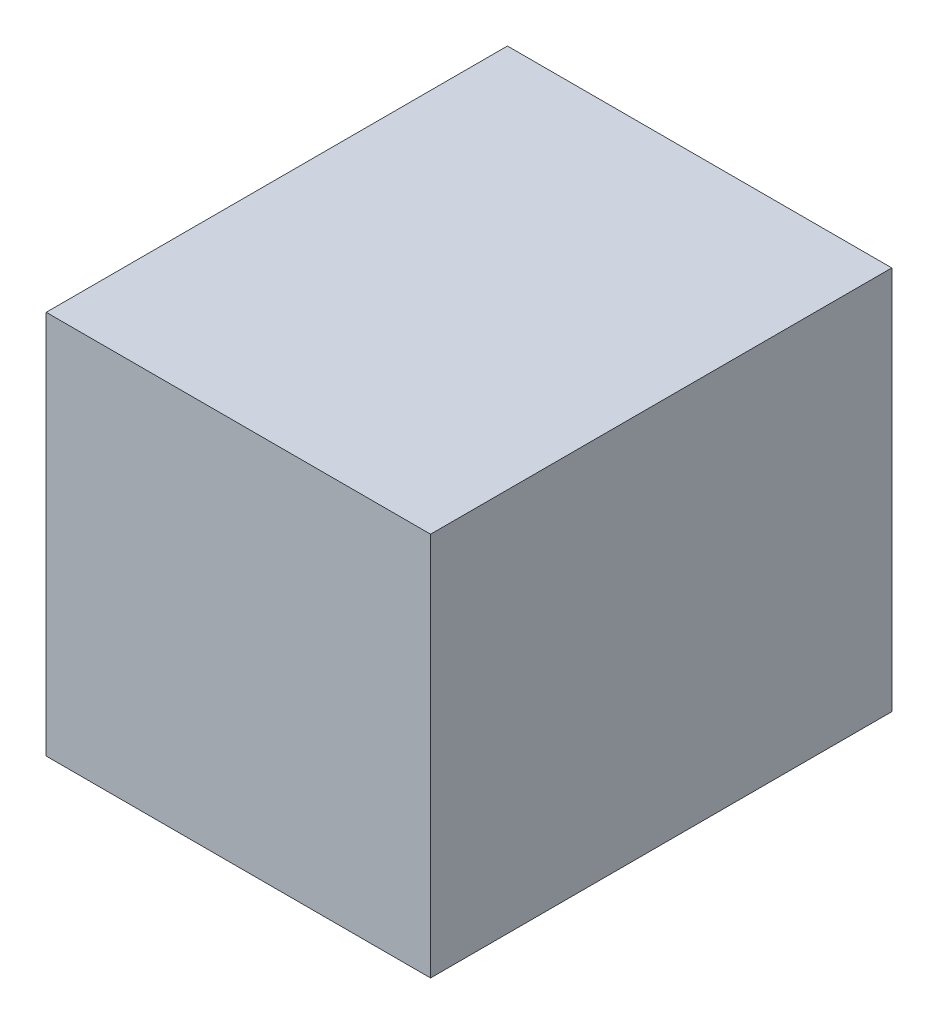
ISO-10303-21;
HEADER;
FILE_DESCRIPTION(('STEP AP214'),'2;1');
FILE_NAME('part.step','',(''),(''),'','','');
FILE_SCHEMA(('AUTOMOTIVE_DESIGN { 1 0 10303 214 1 1 1 1 }'));
ENDSEC;
DATA;
#1=APPLICATION_CONTEXT('core data for automotive mechanical design processes');
#2=APPLICATION_PROTOCOL_DEFINITION('international standard','automotive_design',2000,#1);
#3=PRODUCT_CONTEXT('',#1,'mechanical');
#4=PRODUCT('Part','Part','',(#3));
#5=PRODUCT_RELATED_PRODUCT_CATEGORY('part','',(#4));
#6=PRODUCT_DEFINITION_FORMATION('','',#4);
#7=PRODUCT_DEFINITION_CONTEXT('part definition',#1,'design');
#8=PRODUCT_DEFINITION('design','',#6,#7);
#9=PRODUCT_DEFINITION_SHAPE('','',#8);
#10=(LENGTH_UNIT() NAMED_UNIT(*) SI_UNIT(.MILLI.,.METRE.));
#11=(NAMED_UNIT(*) PLANE_ANGLE_UNIT() SI_UNIT($,.RADIAN.));
#12=(NAMED_UNIT(*) SI_UNIT($,.STERADIAN.) SOLID_ANGLE_UNIT());
#13=UNCERTAINTY_MEASURE_WITH_UNIT(LENGTH_MEASURE(1.E-05),#10,'distance_accuracy_value','');
#14=(GEOMETRIC_REPRESENTATION_CONTEXT(3) GLOBAL_UNCERTAINTY_ASSIGNED_CONTEXT((#13)) GLOBAL_UNIT_ASSIGNED_CONTEXT((#10,
#11,#12)) REPRESENTATION_CONTEXT('',''));
#15=CARTESIAN_POINT('',(0.,0.,0.));
#16=DIRECTION('',(0.,0.,1.));
#17=DIRECTION('',(1.,0.,0.));
#18=AXIS2_PLACEMENT_3D('',#15,#16,#17);
#19=CARTESIAN_POINT('',(2.5,-2.5,3.));
#20=DIRECTION('',(-1.,0.,0.));
#21=DIRECTION('',(0.,0.,1.));
#22=AXIS2_PLACEMENT_3D('',#19,#20,#21);
#23=PLANE('',#22);
#24=DIRECTION('',(0.,1.,0.));
#25=VECTOR('',#24,1.);
#26=CARTESIAN_POINT('',(2.5,-2.5,-3.));
#27=LINE('',#26,#25);
#28=CARTESIAN_POINT('',(2.5,-2.5,-3.));
#29=VERTEX_POINT('',#28);
#30=CARTESIAN_POINT('',(2.5,2.5,-3.));
#31=VERTEX_POINT('',#30);
#32=EDGE_CURVE('E96',#29,#31,#27,.T.);
#33=ORIENTED_EDGE('',*,*,#32,.T.);
#34=DIRECTION('',(0.,0.,-1.));
#35=VECTOR('',#34,1.);
#36=CARTESIAN_POINT('',(2.5,2.5,3.));
#37=LINE('',#36,#35);
#38=CARTESIAN_POINT('',(2.5,2.5,3.));
#39=VERTEX_POINT('',#38);
#40=EDGE_CURVE('E11',#39,#31,#37,.T.);
#41=ORIENTED_EDGE('',*,*,#40,.F.);
#42=DIRECTION('',(0.,1.,0.));
#43=VECTOR('',#42,1.);
#44=CARTESIAN_POINT('',(2.5,-2.5,3.));
#45=LINE('',#44,#43);
#46=CARTESIAN_POINT('',(2.5,-2.5,3.));
#47=VERTEX_POINT('',#46);
#48=EDGE_CURVE('E84',#47,#39,#45,.T.);
#49=ORIENTED_EDGE('',*,*,#48,.F.);
#50=DIRECTION('',(0.,0.,-1.));
#51=VECTOR('',#50,1.);
#52=CARTESIAN_POINT('',(2.5,-2.5,3.));
#53=LINE('',#52,#51);
#54=EDGE_CURVE('E92',#47,#29,#53,.T.);
#55=ORIENTED_EDGE('',*,*,#54,.T.);
#56=EDGE_LOOP('',(#33,#41,#49,#55));
#57=FACE_BOUND('',#56,.T.);
#58=ADVANCED_FACE('F33',(#57),#23,.F.);
#59=CARTESIAN_POINT('',(-2.5,2.5,3.));
#60=DIRECTION('',(0.,-1.,0.));
#61=DIRECTION('',(0.,0.,-1.));
#62=AXIS2_PLACEMENT_3D('',#59,#60,#61);
#63=PLANE('',#62);
#64=DIRECTION('',(-1.,0.,0.));
#65=VECTOR('',#64,1.);
#66=CARTESIAN_POINT('',(-2.5,2.5,-3.));
#67=LINE('',#66,#65);
#68=CARTESIAN_POINT('',(-2.5,2.5,-3.));
#69=VERTEX_POINT('',#68);
#70=EDGE_CURVE('E88',#31,#69,#67,.T.);
#71=ORIENTED_EDGE('',*,*,#70,.T.);
#72=DIRECTION('',(0.,0.,-1.));
#73=VECTOR('',#72,1.);
#74=CARTESIAN_POINT('',(-2.5,2.5,3.));
#75=LINE('',#74,#73);
#76=CARTESIAN_POINT('',(-2.5,2.5,3.));
#77=VERTEX_POINT('',#76);
#78=EDGE_CURVE('E41',#77,#69,#75,.T.);
#79=ORIENTED_EDGE('',*,*,#78,.F.);
#80=DIRECTION('',(-1.,0.,0.));
#81=VECTOR('',#80,1.);
#82=CARTESIAN_POINT('',(-2.5,2.5,3.));
#83=LINE('',#82,#81);
#84=EDGE_CURVE('E79',#39,#77,#83,.T.);
#85=ORIENTED_EDGE('',*,*,#84,.F.);
#86=ORIENTED_EDGE('',*,*,#40,.T.);
#87=EDGE_LOOP('',(#71,#79,#85,#86));
#88=FACE_BOUND('',#87,.T.);
#89=ADVANCED_FACE('F87',(#88),#63,.F.);
#90=CARTESIAN_POINT('',(-2.5,-2.5,3.));
#91=DIRECTION('',(1.,0.,0.));
#92=DIRECTION('',(0.,0.,-1.));
#93=AXIS2_PLACEMENT_3D('',#90,#91,#92);
#94=PLANE('',#93);
#95=DIRECTION('',(0.,-1.,0.));
#96=VECTOR('',#95,1.);
#97=CARTESIAN_POINT('',(-2.5,-2.5,-3.));
#98=LINE('',#97,#96);
#99=CARTESIAN_POINT('',(-2.5,-2.5,-3.));
#100=VERTEX_POINT('',#99);
#101=EDGE_CURVE('E66',#69,#100,#98,.T.);
#102=ORIENTED_EDGE('',*,*,#101,.T.);
#103=DIRECTION('',(0.,0.,-1.));
#104=VECTOR('',#103,1.);
#105=CARTESIAN_POINT('',(-2.5,-2.5,3.));
#106=LINE('',#105,#104);
#107=CARTESIAN_POINT('',(-2.5,-2.5,3.));
#108=VERTEX_POINT('',#107);
#109=EDGE_CURVE('E89',#108,#100,#106,.T.);
#110=ORIENTED_EDGE('',*,*,#109,.F.);
#111=DIRECTION('',(0.,-1.,0.));
#112=VECTOR('',#111,1.);
#113=CARTESIAN_POINT('',(-2.5,-2.5,3.));
#114=LINE('',#113,#112);
#115=EDGE_CURVE('E82',#77,#108,#114,.T.);
#116=ORIENTED_EDGE('',*,*,#115,.F.);
#117=ORIENTED_EDGE('',*,*,#78,.T.);
#118=EDGE_LOOP('',(#102,#110,#116,#117));
#119=FACE_BOUND('',#118,.T.);
#120=ADVANCED_FACE('F90',(#119),#94,.F.);
#121=CARTESIAN_POINT('',(-2.5,-2.5,3.));
#122=DIRECTION('',(0.,1.,0.));
#123=DIRECTION('',(0.,0.,1.));
#124=AXIS2_PLACEMENT_3D('',#121,#122,#123);
#125=PLANE('',#124);
#126=DIRECTION('',(1.,0.,0.));
#127=VECTOR('',#126,1.);
#128=CARTESIAN_POINT('',(-2.5,-2.5,-3.));
#129=LINE('',#128,#127);
#130=EDGE_CURVE('E72',#100,#29,#129,.T.);
#131=ORIENTED_EDGE('',*,*,#130,.T.);
#132=ORIENTED_EDGE('',*,*,#54,.F.);
#133=DIRECTION('',(1.,0.,0.));
#134=VECTOR('',#133,1.);
#135=CARTESIAN_POINT('',(-2.5,-2.5,3.));
#136=LINE('',#135,#134);
#137=EDGE_CURVE('E49',#108,#47,#136,.T.);
#138=ORIENTED_EDGE('',*,*,#137,.F.);
#139=ORIENTED_EDGE('',*,*,#109,.T.);
#140=EDGE_LOOP('',(#131,#132,#138,#139));
#141=FACE_BOUND('',#140,.T.);
#142=ADVANCED_FACE('F103',(#141),#125,.F.);
#143=CARTESIAN_POINT('',(0.,0.,3.));
#144=DIRECTION('',(0.,0.,-1.));
#145=DIRECTION('',(-1.,0.,0.));
#146=AXIS2_PLACEMENT_3D('',#143,#144,#145);
#147=PLANE('',#146);
#148=ORIENTED_EDGE('',*,*,#48,.T.);
#149=ORIENTED_EDGE('',*,*,#84,.T.);
#150=ORIENTED_EDGE('',*,*,#115,.T.);
#151=ORIENTED_EDGE('',*,*,#137,.T.);
#152=EDGE_LOOP('',(#148,#149,#150,#151));
#153=FACE_BOUND('',#152,.T.);
#154=ADVANCED_FACE('F80',(#153),#147,.F.);
#155=CARTESIAN_POINT('',(0.,0.,-3.));
#156=DIRECTION('',(0.,0.,-1.));
#157=DIRECTION('',(-1.,0.,0.));
#158=AXIS2_PLACEMENT_3D('',#155,#156,#157);
#159=PLANE('',#158);
#160=ORIENTED_EDGE('',*,*,#32,.F.);
#161=ORIENTED_EDGE('',*,*,#130,.F.);
#162=ORIENTED_EDGE('',*,*,#101,.F.);
#163=ORIENTED_EDGE('',*,*,#70,.F.);
#164=EDGE_LOOP('',(#160,#161,#162,#163));
#165=FACE_BOUND('',#164,.T.);
#166=ADVANCED_FACE('F106',(#165),#159,.T.);
#167=CLOSED_SHELL('',(#58,#89,#120,#142,#154,#166));
#168=MANIFOLD_SOLID_BREP('B2',#167);
#169=ADVANCED_BREP_SHAPE_REPRESENTATION('',(#18,#168),#14);
#170=SHAPE_DEFINITION_REPRESENTATION(#9,#169);
ENDSEC;
END-ISO-10303-21;
